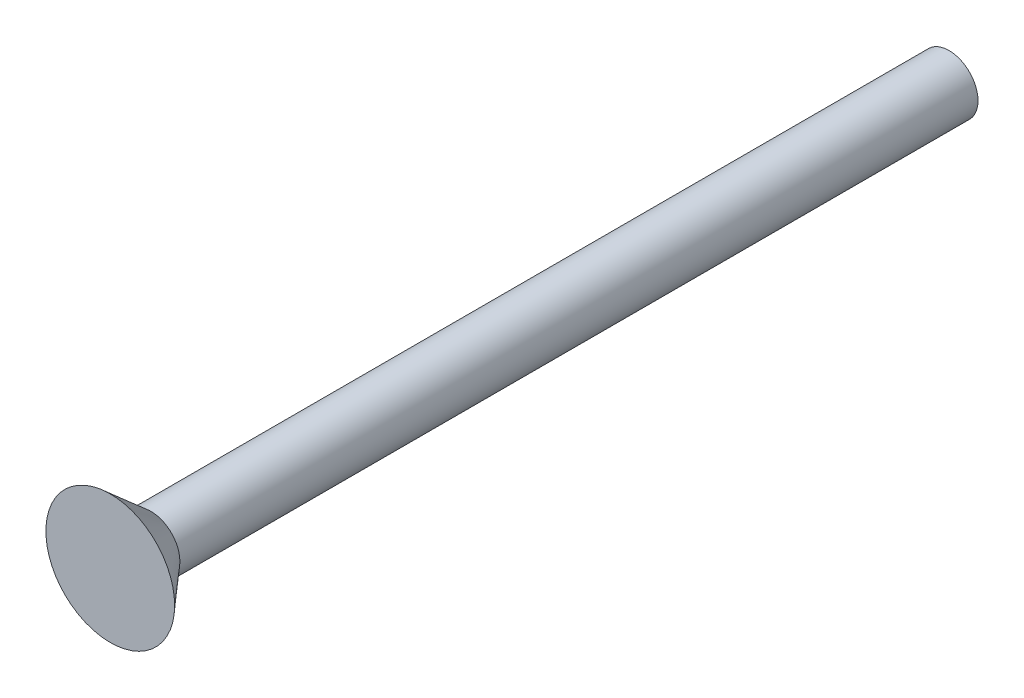
ISO-10303-21;
HEADER;
FILE_DESCRIPTION(('STEP AP214'),'2;1');
FILE_NAME('part.step','',(''),(''),'','','');
FILE_SCHEMA(('AUTOMOTIVE_DESIGN { 1 0 10303 214 1 1 1 1 }'));
ENDSEC;
DATA;
#1=APPLICATION_CONTEXT('core data for automotive mechanical design processes');
#2=APPLICATION_PROTOCOL_DEFINITION('international standard','automotive_design',2000,#1);
#3=PRODUCT_CONTEXT('',#1,'mechanical');
#4=PRODUCT('Part','Part','',(#3));
#5=PRODUCT_RELATED_PRODUCT_CATEGORY('part','',(#4));
#6=PRODUCT_DEFINITION_FORMATION('','',#4);
#7=PRODUCT_DEFINITION_CONTEXT('part definition',#1,'design');
#8=PRODUCT_DEFINITION('design','',#6,#7);
#9=PRODUCT_DEFINITION_SHAPE('','',#8);
#10=(LENGTH_UNIT() NAMED_UNIT(*) SI_UNIT(.MILLI.,.METRE.));
#11=(NAMED_UNIT(*) PLANE_ANGLE_UNIT() SI_UNIT($,.RADIAN.));
#12=(NAMED_UNIT(*) SI_UNIT($,.STERADIAN.) SOLID_ANGLE_UNIT());
#13=UNCERTAINTY_MEASURE_WITH_UNIT(LENGTH_MEASURE(1.E-05),#10,'distance_accuracy_value','');
#14=(GEOMETRIC_REPRESENTATION_CONTEXT(3) GLOBAL_UNCERTAINTY_ASSIGNED_CONTEXT((#13)) GLOBAL_UNIT_ASSIGNED_CONTEXT((#10,
#11,#12)) REPRESENTATION_CONTEXT('',''));
#15=CARTESIAN_POINT('',(0.,0.,0.));
#16=DIRECTION('',(0.,0.,1.));
#17=DIRECTION('',(1.,0.,0.));
#18=AXIS2_PLACEMENT_3D('',#15,#16,#17);
#19=CARTESIAN_POINT('',(0.,0.,-50.8));
#20=DIRECTION('',(0.,0.,1.));
#21=DIRECTION('',(1.,0.,0.));
#22=AXIS2_PLACEMENT_3D('',#19,#20,#21);
#23=CYLINDRICAL_SURFACE('',#22,1.7526);
#24=CARTESIAN_POINT('',(0.,0.,-50.8));
#25=DIRECTION('',(0.,0.,1.));
#26=DIRECTION('',(1.,0.,0.));
#27=AXIS2_PLACEMENT_3D('',#24,#25,#26);
#28=CIRCLE('',#27,1.7526);
#29=CARTESIAN_POINT('',(1.7526,0.,-50.8));
#30=VERTEX_POINT('',#29);
#31=EDGE_CURVE('E10',#30,#30,#28,.T.);
#32=ORIENTED_EDGE('',*,*,#31,.T.);
#33=EDGE_LOOP('',(#32));
#34=FACE_BOUND('',#33,.T.);
#35=CARTESIAN_POINT('',(0.,0.,-2.4638));
#36=DIRECTION('',(0.,0.,1.));
#37=DIRECTION('',(1.,0.,0.));
#38=AXIS2_PLACEMENT_3D('',#35,#36,#37);
#39=CIRCLE('',#38,1.7526);
#40=CARTESIAN_POINT('',(1.7526,0.,-2.4638));
#41=VERTEX_POINT('',#40);
#42=EDGE_CURVE('E45',#41,#41,#39,.T.);
#43=ORIENTED_EDGE('',*,*,#42,.F.);
#44=EDGE_LOOP('',(#43));
#45=FACE_BOUND('',#44,.T.);
#46=ADVANCED_FACE('F35',(#34,#45),#23,.T.);
#47=CARTESIAN_POINT('',(0.,0.,-50.8));
#48=DIRECTION('',(0.,0.,1.));
#49=DIRECTION('',(1.,0.,0.));
#50=AXIS2_PLACEMENT_3D('',#47,#48,#49);
#51=PLANE('',#50);
#52=ORIENTED_EDGE('',*,*,#31,.F.);
#53=EDGE_LOOP('',(#52));
#54=FACE_BOUND('',#53,.T.);
#55=ADVANCED_FACE('F55',(#54),#51,.F.);
#56=CARTESIAN_POINT('',(0.,0.,-2.4638));
#57=DIRECTION('',(0.,0.,1.));
#58=DIRECTION('',(1.,0.,0.));
#59=AXIS2_PLACEMENT_3D('',#56,#57,#58);
#60=CONICAL_SURFACE('',#59,1.7526,0.716636218863069);
#61=CARTESIAN_POINT('',(0.,0.,0.));
#62=DIRECTION('',(0.,0.,1.));
#63=DIRECTION('',(1.,0.,0.));
#64=AXIS2_PLACEMENT_3D('',#61,#62,#63);
#65=CIRCLE('',#64,3.8989);
#66=CARTESIAN_POINT('',(3.8989,0.,0.));
#67=VERTEX_POINT('',#66);
#68=EDGE_CURVE('E41',#67,#67,#65,.T.);
#69=ORIENTED_EDGE('',*,*,#68,.F.);
#70=EDGE_LOOP('',(#69));
#71=FACE_BOUND('',#70,.T.);
#72=ORIENTED_EDGE('',*,*,#42,.T.);
#73=EDGE_LOOP('',(#72));
#74=FACE_BOUND('',#73,.T.);
#75=ADVANCED_FACE('F52',(#71,#74),#60,.T.);
#76=CARTESIAN_POINT('',(0.,0.,0.));
#77=DIRECTION('',(0.,0.,1.));
#78=DIRECTION('',(1.,0.,0.));
#79=AXIS2_PLACEMENT_3D('',#76,#77,#78);
#80=PLANE('',#79);
#81=ORIENTED_EDGE('',*,*,#68,.T.);
#82=EDGE_LOOP('',(#81));
#83=FACE_BOUND('',#82,.T.);
#84=ADVANCED_FACE('F64',(#83),#80,.T.);
#85=CLOSED_SHELL('',(#46,#55,#75,#84));
#86=MANIFOLD_SOLID_BREP('B2',#85);
#87=ADVANCED_BREP_SHAPE_REPRESENTATION('',(#18,#86),#14);
#88=SHAPE_DEFINITION_REPRESENTATION(#9,#87);
ENDSEC;
END-ISO-10303-21;
